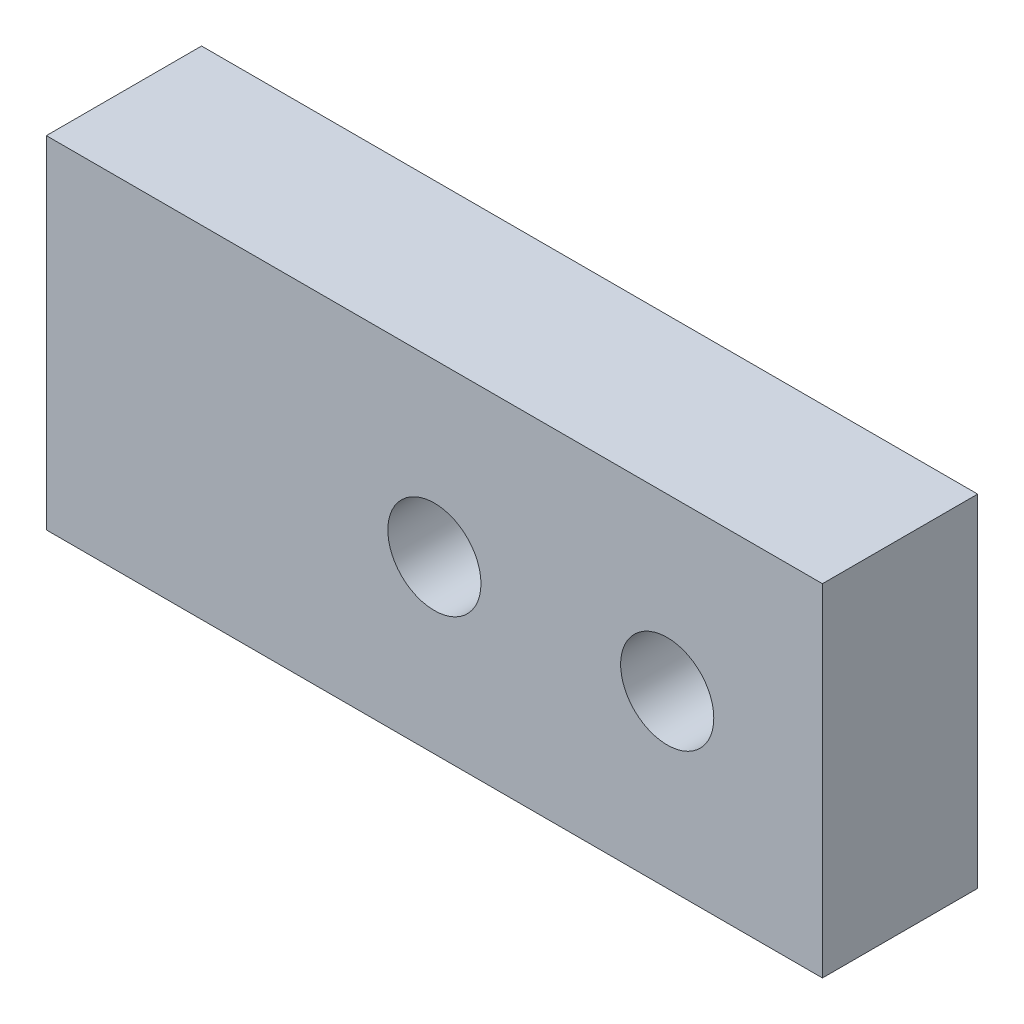
ISO-10303-21;
HEADER;
FILE_DESCRIPTION(('STEP AP214'),'2;1');
FILE_NAME('part.step','',(''),(''),'','','');
FILE_SCHEMA(('AUTOMOTIVE_DESIGN { 1 0 10303 214 1 1 1 1 }'));
ENDSEC;
DATA;
#1=APPLICATION_CONTEXT('core data for automotive mechanical design processes');
#2=APPLICATION_PROTOCOL_DEFINITION('international standard','automotive_design',2000,#1);
#3=PRODUCT_CONTEXT('',#1,'mechanical');
#4=PRODUCT('Part','Part','',(#3));
#5=PRODUCT_RELATED_PRODUCT_CATEGORY('part','',(#4));
#6=PRODUCT_DEFINITION_FORMATION('','',#4);
#7=PRODUCT_DEFINITION_CONTEXT('part definition',#1,'design');
#8=PRODUCT_DEFINITION('design','',#6,#7);
#9=PRODUCT_DEFINITION_SHAPE('','',#8);
#10=(LENGTH_UNIT() NAMED_UNIT(*) SI_UNIT(.MILLI.,.METRE.));
#11=(NAMED_UNIT(*) PLANE_ANGLE_UNIT() SI_UNIT($,.RADIAN.));
#12=(NAMED_UNIT(*) SI_UNIT($,.STERADIAN.) SOLID_ANGLE_UNIT());
#13=UNCERTAINTY_MEASURE_WITH_UNIT(LENGTH_MEASURE(1.E-05),#10,'distance_accuracy_value','');
#14=(GEOMETRIC_REPRESENTATION_CONTEXT(3) GLOBAL_UNCERTAINTY_ASSIGNED_CONTEXT((#13)) GLOBAL_UNIT_ASSIGNED_CONTEXT((#10,
#11,#12)) REPRESENTATION_CONTEXT('',''));
#15=CARTESIAN_POINT('',(0.,0.,0.));
#16=DIRECTION('',(0.,0.,1.));
#17=DIRECTION('',(1.,0.,0.));
#18=AXIS2_PLACEMENT_3D('',#15,#16,#17);
#19=CARTESIAN_POINT('',(25.,-11.,10.));
#20=DIRECTION('',(-1.,0.,0.));
#21=DIRECTION('',(0.,0.,1.));
#22=AXIS2_PLACEMENT_3D('',#19,#20,#21);
#23=PLANE('',#22);
#24=DIRECTION('',(0.,1.,0.));
#25=VECTOR('',#24,1.);
#26=CARTESIAN_POINT('',(25.,-11.,0.));
#27=LINE('',#26,#25);
#28=CARTESIAN_POINT('',(25.,-11.,0.));
#29=VERTEX_POINT('',#28);
#30=CARTESIAN_POINT('',(25.,11.,0.));
#31=VERTEX_POINT('',#30);
#32=EDGE_CURVE('E113',#29,#31,#27,.T.);
#33=ORIENTED_EDGE('',*,*,#32,.T.);
#34=DIRECTION('',(0.,0.,-1.));
#35=VECTOR('',#34,1.);
#36=CARTESIAN_POINT('',(25.,11.,10.));
#37=LINE('',#36,#35);
#38=CARTESIAN_POINT('',(25.,11.,10.));
#39=VERTEX_POINT('',#38);
#40=EDGE_CURVE('E11',#39,#31,#37,.T.);
#41=ORIENTED_EDGE('',*,*,#40,.F.);
#42=DIRECTION('',(0.,1.,0.));
#43=VECTOR('',#42,1.);
#44=CARTESIAN_POINT('',(25.,-11.,10.));
#45=LINE('',#44,#43);
#46=CARTESIAN_POINT('',(25.,-11.,10.));
#47=VERTEX_POINT('',#46);
#48=EDGE_CURVE('E114',#47,#39,#45,.T.);
#49=ORIENTED_EDGE('',*,*,#48,.F.);
#50=DIRECTION('',(0.,0.,-1.));
#51=VECTOR('',#50,1.);
#52=CARTESIAN_POINT('',(25.,-11.,10.));
#53=LINE('',#52,#51);
#54=EDGE_CURVE('E120',#47,#29,#53,.T.);
#55=ORIENTED_EDGE('',*,*,#54,.T.);
#56=EDGE_LOOP('',(#33,#41,#49,#55));
#57=FACE_BOUND('',#56,.T.);
#58=ADVANCED_FACE('F36',(#57),#23,.F.);
#59=CARTESIAN_POINT('',(-25.,11.,10.));
#60=DIRECTION('',(0.,-1.,0.));
#61=DIRECTION('',(0.,0.,-1.));
#62=AXIS2_PLACEMENT_3D('',#59,#60,#61);
#63=PLANE('',#62);
#64=DIRECTION('',(-1.,0.,0.));
#65=VECTOR('',#64,1.);
#66=CARTESIAN_POINT('',(-25.,11.,0.));
#67=LINE('',#66,#65);
#68=CARTESIAN_POINT('',(-25.,11.,0.));
#69=VERTEX_POINT('',#68);
#70=EDGE_CURVE('E123',#31,#69,#67,.T.);
#71=ORIENTED_EDGE('',*,*,#70,.T.);
#72=DIRECTION('',(0.,0.,-1.));
#73=VECTOR('',#72,1.);
#74=CARTESIAN_POINT('',(-25.,11.,10.));
#75=LINE('',#74,#73);
#76=CARTESIAN_POINT('',(-25.,11.,10.));
#77=VERTEX_POINT('',#76);
#78=EDGE_CURVE('E44',#77,#69,#75,.T.);
#79=ORIENTED_EDGE('',*,*,#78,.F.);
#80=DIRECTION('',(-1.,0.,0.));
#81=VECTOR('',#80,1.);
#82=CARTESIAN_POINT('',(-25.,11.,10.));
#83=LINE('',#82,#81);
#84=EDGE_CURVE('E83',#39,#77,#83,.T.);
#85=ORIENTED_EDGE('',*,*,#84,.F.);
#86=ORIENTED_EDGE('',*,*,#40,.T.);
#87=EDGE_LOOP('',(#71,#79,#85,#86));
#88=FACE_BOUND('',#87,.T.);
#89=ADVANCED_FACE('F147',(#88),#63,.F.);
#90=CARTESIAN_POINT('',(-25.,-11.,10.));
#91=DIRECTION('',(1.,0.,0.));
#92=DIRECTION('',(0.,0.,-1.));
#93=AXIS2_PLACEMENT_3D('',#90,#91,#92);
#94=PLANE('',#93);
#95=CARTESIAN_POINT('',(-25.,-6.,5.));
#96=DIRECTION('',(-1.,0.,0.));
#97=DIRECTION('',(0.,0.,1.));
#98=AXIS2_PLACEMENT_3D('',#95,#96,#97);
#99=CIRCLE('',#98,2.09999999999999);
#100=CARTESIAN_POINT('',(-25.,-6.,7.09999999999999));
#101=VERTEX_POINT('',#100);
#102=EDGE_CURVE('E101',#101,#101,#99,.T.);
#103=ORIENTED_EDGE('',*,*,#102,.F.);
#104=EDGE_LOOP('',(#103));
#105=FACE_BOUND('',#104,.T.);
#106=CARTESIAN_POINT('',(-25.,6.,5.));
#107=DIRECTION('',(-1.,0.,0.));
#108=DIRECTION('',(0.,0.,1.));
#109=AXIS2_PLACEMENT_3D('',#106,#107,#108);
#110=CIRCLE('',#109,2.09999999999999);
#111=CARTESIAN_POINT('',(-25.,6.,7.09999999999999));
#112=VERTEX_POINT('',#111);
#113=EDGE_CURVE('E100',#112,#112,#110,.T.);
#114=ORIENTED_EDGE('',*,*,#113,.F.);
#115=EDGE_LOOP('',(#114));
#116=FACE_BOUND('',#115,.T.);
#117=DIRECTION('',(0.,-1.,0.));
#118=VECTOR('',#117,1.);
#119=CARTESIAN_POINT('',(-25.,-11.,0.));
#120=LINE('',#119,#118);
#121=CARTESIAN_POINT('',(-25.,-11.,0.));
#122=VERTEX_POINT('',#121);
#123=EDGE_CURVE('E70',#69,#122,#120,.T.);
#124=ORIENTED_EDGE('',*,*,#123,.T.);
#125=DIRECTION('',(0.,0.,-1.));
#126=VECTOR('',#125,1.);
#127=CARTESIAN_POINT('',(-25.,-11.,10.));
#128=LINE('',#127,#126);
#129=CARTESIAN_POINT('',(-25.,-11.,10.));
#130=VERTEX_POINT('',#129);
#131=EDGE_CURVE('E128',#130,#122,#128,.T.);
#132=ORIENTED_EDGE('',*,*,#131,.F.);
#133=DIRECTION('',(0.,-1.,0.));
#134=VECTOR('',#133,1.);
#135=CARTESIAN_POINT('',(-25.,-11.,10.));
#136=LINE('',#135,#134);
#137=EDGE_CURVE('E117',#77,#130,#136,.T.);
#138=ORIENTED_EDGE('',*,*,#137,.F.);
#139=ORIENTED_EDGE('',*,*,#78,.T.);
#140=EDGE_LOOP('',(#124,#132,#138,#139));
#141=FACE_BOUND('',#140,.T.);
#142=ADVANCED_FACE('F130',(#105,#116,#141),#94,.F.);
#143=CARTESIAN_POINT('',(-25.,-11.,10.));
#144=DIRECTION('',(0.,1.,0.));
#145=DIRECTION('',(0.,0.,1.));
#146=AXIS2_PLACEMENT_3D('',#143,#144,#145);
#147=PLANE('',#146);
#148=DIRECTION('',(1.,0.,0.));
#149=VECTOR('',#148,1.);
#150=CARTESIAN_POINT('',(-25.,-11.,0.));
#151=LINE('',#150,#149);
#152=EDGE_CURVE('E76',#122,#29,#151,.T.);
#153=ORIENTED_EDGE('',*,*,#152,.T.);
#154=ORIENTED_EDGE('',*,*,#54,.F.);
#155=DIRECTION('',(1.,0.,0.));
#156=VECTOR('',#155,1.);
#157=CARTESIAN_POINT('',(-25.,-11.,10.));
#158=LINE('',#157,#156);
#159=EDGE_CURVE('E52',#130,#47,#158,.T.);
#160=ORIENTED_EDGE('',*,*,#159,.F.);
#161=ORIENTED_EDGE('',*,*,#131,.T.);
#162=EDGE_LOOP('',(#153,#154,#160,#161));
#163=FACE_BOUND('',#162,.T.);
#164=ADVANCED_FACE('F137',(#163),#147,.F.);
#165=CARTESIAN_POINT('',(0.,0.,10.));
#166=DIRECTION('',(0.,0.,-1.));
#167=DIRECTION('',(-1.,0.,0.));
#168=AXIS2_PLACEMENT_3D('',#165,#166,#167);
#169=PLANE('',#168);
#170=CARTESIAN_POINT('',(0.,0.,10.));
#171=DIRECTION('',(0.,0.,1.));
#172=DIRECTION('',(1.,0.,0.));
#173=AXIS2_PLACEMENT_3D('',#170,#171,#172);
#174=CIRCLE('',#173,3.);
#175=CARTESIAN_POINT('',(3.,0.,10.));
#176=VERTEX_POINT('',#175);
#177=EDGE_CURVE('E244',#176,#176,#174,.T.);
#178=ORIENTED_EDGE('',*,*,#177,.F.);
#179=EDGE_LOOP('',(#178));
#180=FACE_BOUND('',#179,.T.);
#181=CARTESIAN_POINT('',(15.,0.,10.));
#182=DIRECTION('',(0.,0.,1.));
#183=DIRECTION('',(1.,0.,0.));
#184=AXIS2_PLACEMENT_3D('',#181,#182,#183);
#185=CIRCLE('',#184,3.);
#186=CARTESIAN_POINT('',(18.,0.,10.));
#187=VERTEX_POINT('',#186);
#188=EDGE_CURVE('E246',#187,#187,#185,.T.);
#189=ORIENTED_EDGE('',*,*,#188,.F.);
#190=EDGE_LOOP('',(#189));
#191=FACE_BOUND('',#190,.T.);
#192=ORIENTED_EDGE('',*,*,#48,.T.);
#193=ORIENTED_EDGE('',*,*,#84,.T.);
#194=ORIENTED_EDGE('',*,*,#137,.T.);
#195=ORIENTED_EDGE('',*,*,#159,.T.);
#196=EDGE_LOOP('',(#192,#193,#194,#195));
#197=FACE_BOUND('',#196,.T.);
#198=ADVANCED_FACE('F139',(#180,#191,#197),#169,.F.);
#199=CARTESIAN_POINT('',(0.,0.,0.));
#200=DIRECTION('',(0.,0.,-1.));
#201=DIRECTION('',(-1.,0.,0.));
#202=AXIS2_PLACEMENT_3D('',#199,#200,#201);
#203=PLANE('',#202);
#204=CARTESIAN_POINT('',(0.,0.,0.));
#205=DIRECTION('',(0.,0.,1.));
#206=DIRECTION('',(1.,0.,0.));
#207=AXIS2_PLACEMENT_3D('',#204,#205,#206);
#208=CIRCLE('',#207,3.);
#209=CARTESIAN_POINT('',(3.,0.,0.));
#210=VERTEX_POINT('',#209);
#211=EDGE_CURVE('E241',#210,#210,#208,.T.);
#212=ORIENTED_EDGE('',*,*,#211,.T.);
#213=EDGE_LOOP('',(#212));
#214=FACE_BOUND('',#213,.T.);
#215=CARTESIAN_POINT('',(15.,0.,0.));
#216=DIRECTION('',(0.,0.,1.));
#217=DIRECTION('',(1.,0.,0.));
#218=AXIS2_PLACEMENT_3D('',#215,#216,#217);
#219=CIRCLE('',#218,3.);
#220=CARTESIAN_POINT('',(18.,0.,0.));
#221=VERTEX_POINT('',#220);
#222=EDGE_CURVE('E107',#221,#221,#219,.T.);
#223=ORIENTED_EDGE('',*,*,#222,.T.);
#224=EDGE_LOOP('',(#223));
#225=FACE_BOUND('',#224,.T.);
#226=ORIENTED_EDGE('',*,*,#32,.F.);
#227=ORIENTED_EDGE('',*,*,#152,.F.);
#228=ORIENTED_EDGE('',*,*,#123,.F.);
#229=ORIENTED_EDGE('',*,*,#70,.F.);
#230=EDGE_LOOP('',(#226,#227,#228,#229));
#231=FACE_BOUND('',#230,.T.);
#232=ADVANCED_FACE('F133',(#214,#225,#231),#203,.T.);
#233=CARTESIAN_POINT('',(-11.,6.,5.));
#234=DIRECTION('',(-1.,0.,0.));
#235=DIRECTION('',(0.,0.,1.));
#236=AXIS2_PLACEMENT_3D('',#233,#234,#235);
#237=CONICAL_SURFACE('',#236,2.1,1.02974425867665);
#238=CARTESIAN_POINT('',(-9.73819270004213,6.,5.));
#239=VERTEX_POINT('',#238);
#240=VERTEX_LOOP('',#239);
#241=FACE_BOUND('',#240,.T.);
#242=CARTESIAN_POINT('',(-11.,6.,5.));
#243=DIRECTION('',(-1.,0.,0.));
#244=DIRECTION('',(0.,0.,1.));
#245=AXIS2_PLACEMENT_3D('',#242,#243,#244);
#246=CIRCLE('',#245,2.1);
#247=CARTESIAN_POINT('',(-11.,6.,7.1));
#248=VERTEX_POINT('',#247);
#249=EDGE_CURVE('E104',#248,#248,#246,.T.);
#250=ORIENTED_EDGE('',*,*,#249,.T.);
#251=EDGE_LOOP('',(#250));
#252=FACE_BOUND('',#251,.T.);
#253=ADVANCED_FACE('F168',(#241,#252),#237,.F.);
#254=CARTESIAN_POINT('',(-25.,6.,5.));
#255=DIRECTION('',(-1.,0.,0.));
#256=DIRECTION('',(0.,0.,1.));
#257=AXIS2_PLACEMENT_3D('',#254,#255,#256);
#258=CYLINDRICAL_SURFACE('',#257,2.09999999999999);
#259=ORIENTED_EDGE('',*,*,#249,.F.);
#260=EDGE_LOOP('',(#259));
#261=FACE_BOUND('',#260,.T.);
#262=ORIENTED_EDGE('',*,*,#113,.T.);
#263=EDGE_LOOP('',(#262));
#264=FACE_BOUND('',#263,.T.);
#265=ADVANCED_FACE('F94',(#261,#264),#258,.F.);
#266=CARTESIAN_POINT('',(-11.,-6.,5.));
#267=DIRECTION('',(-1.,0.,0.));
#268=DIRECTION('',(0.,0.,1.));
#269=AXIS2_PLACEMENT_3D('',#266,#267,#268);
#270=CONICAL_SURFACE('',#269,2.1,1.02974425867665);
#271=CARTESIAN_POINT('',(-9.73819270004213,-6.,5.));
#272=VERTEX_POINT('',#271);
#273=VERTEX_LOOP('',#272);
#274=FACE_BOUND('',#273,.T.);
#275=CARTESIAN_POINT('',(-11.,-6.,5.));
#276=DIRECTION('',(-1.,0.,0.));
#277=DIRECTION('',(0.,0.,1.));
#278=AXIS2_PLACEMENT_3D('',#275,#276,#277);
#279=CIRCLE('',#278,2.1);
#280=CARTESIAN_POINT('',(-11.,-6.,7.1));
#281=VERTEX_POINT('',#280);
#282=EDGE_CURVE('E98',#281,#281,#279,.T.);
#283=ORIENTED_EDGE('',*,*,#282,.T.);
#284=EDGE_LOOP('',(#283));
#285=FACE_BOUND('',#284,.T.);
#286=ADVANCED_FACE('F90',(#274,#285),#270,.F.);
#287=CARTESIAN_POINT('',(-25.,-6.,5.));
#288=DIRECTION('',(-1.,0.,0.));
#289=DIRECTION('',(0.,0.,1.));
#290=AXIS2_PLACEMENT_3D('',#287,#288,#289);
#291=CYLINDRICAL_SURFACE('',#290,2.09999999999999);
#292=ORIENTED_EDGE('',*,*,#282,.F.);
#293=EDGE_LOOP('',(#292));
#294=FACE_BOUND('',#293,.T.);
#295=ORIENTED_EDGE('',*,*,#102,.T.);
#296=EDGE_LOOP('',(#295));
#297=FACE_BOUND('',#296,.T.);
#298=ADVANCED_FACE('F93',(#294,#297),#291,.F.);
#299=CARTESIAN_POINT('',(15.,0.,0.));
#300=DIRECTION('',(0.,0.,1.));
#301=DIRECTION('',(1.,0.,0.));
#302=AXIS2_PLACEMENT_3D('',#299,#300,#301);
#303=CYLINDRICAL_SURFACE('',#302,3.);
#304=ORIENTED_EDGE('',*,*,#222,.F.);
#305=EDGE_LOOP('',(#304));
#306=FACE_BOUND('',#305,.T.);
#307=ORIENTED_EDGE('',*,*,#188,.T.);
#308=EDGE_LOOP('',(#307));
#309=FACE_BOUND('',#308,.T.);
#310=ADVANCED_FACE('F202',(#306,#309),#303,.F.);
#311=CARTESIAN_POINT('',(0.,0.,0.));
#312=DIRECTION('',(0.,0.,1.));
#313=DIRECTION('',(1.,0.,0.));
#314=AXIS2_PLACEMENT_3D('',#311,#312,#313);
#315=CYLINDRICAL_SURFACE('',#314,3.);
#316=ORIENTED_EDGE('',*,*,#211,.F.);
#317=EDGE_LOOP('',(#316));
#318=FACE_BOUND('',#317,.T.);
#319=ORIENTED_EDGE('',*,*,#177,.T.);
#320=EDGE_LOOP('',(#319));
#321=FACE_BOUND('',#320,.T.);
#322=ADVANCED_FACE('F224',(#318,#321),#315,.F.);
#323=CLOSED_SHELL('',(#58,#89,#142,#164,#198,#232,#253,#265,#286,#298,#310,#322));
#324=MANIFOLD_SOLID_BREP('B2',#323);
#325=ADVANCED_BREP_SHAPE_REPRESENTATION('',(#18,#324),#14);
#326=SHAPE_DEFINITION_REPRESENTATION(#9,#325);
ENDSEC;
END-ISO-10303-21;
